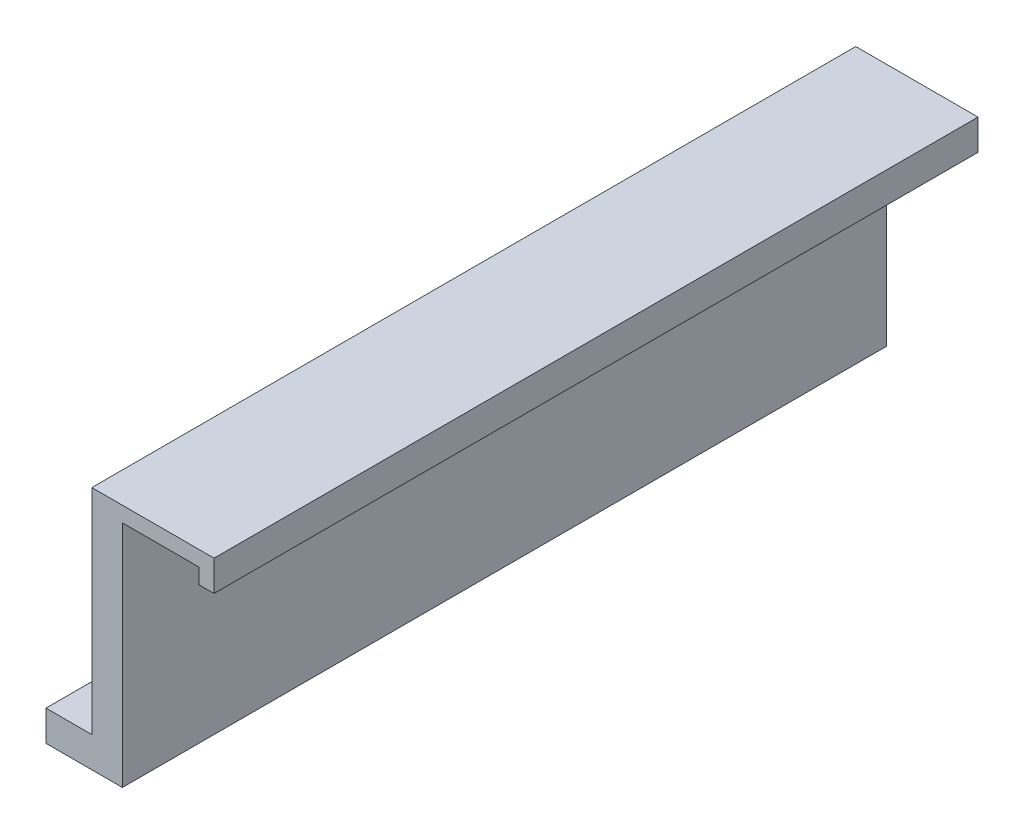
ISO-10303-21;
HEADER;
FILE_DESCRIPTION(('STEP AP214'),'2;1');
FILE_NAME('part.step','',(''),(''),'','','');
FILE_SCHEMA(('AUTOMOTIVE_DESIGN { 1 0 10303 214 1 1 1 1 }'));
ENDSEC;
DATA;
#1=APPLICATION_CONTEXT('core data for automotive mechanical design processes');
#2=APPLICATION_PROTOCOL_DEFINITION('international standard','automotive_design',2000,#1);
#3=PRODUCT_CONTEXT('',#1,'mechanical');
#4=PRODUCT('Part','Part','',(#3));
#5=PRODUCT_RELATED_PRODUCT_CATEGORY('part','',(#4));
#6=PRODUCT_DEFINITION_FORMATION('','',#4);
#7=PRODUCT_DEFINITION_CONTEXT('part definition',#1,'design');
#8=PRODUCT_DEFINITION('design','',#6,#7);
#9=PRODUCT_DEFINITION_SHAPE('','',#8);
#10=(LENGTH_UNIT() NAMED_UNIT(*) SI_UNIT(.MILLI.,.METRE.));
#11=(NAMED_UNIT(*) PLANE_ANGLE_UNIT() SI_UNIT($,.RADIAN.));
#12=(NAMED_UNIT(*) SI_UNIT($,.STERADIAN.) SOLID_ANGLE_UNIT());
#13=UNCERTAINTY_MEASURE_WITH_UNIT(LENGTH_MEASURE(1.E-05),#10,'distance_accuracy_value','');
#14=(GEOMETRIC_REPRESENTATION_CONTEXT(3) GLOBAL_UNCERTAINTY_ASSIGNED_CONTEXT((#13)) GLOBAL_UNIT_ASSIGNED_CONTEXT((#10,
#11,#12)) REPRESENTATION_CONTEXT('',''));
#15=CARTESIAN_POINT('',(0.,0.,0.));
#16=DIRECTION('',(0.,0.,1.));
#17=DIRECTION('',(1.,0.,0.));
#18=AXIS2_PLACEMENT_3D('',#15,#16,#17);
#19=CARTESIAN_POINT('',(0.,0.,0.));
#20=DIRECTION('',(1.,0.,0.));
#21=DIRECTION('',(0.,0.,1.));
#22=AXIS2_PLACEMENT_3D('',#19,#20,#21);
#23=PLANE('',#22);
#24=DIRECTION('',(0.,0.,-1.));
#25=VECTOR('',#24,1.);
#26=CARTESIAN_POINT('',(0.,0.,-100.));
#27=LINE('',#26,#25);
#28=CARTESIAN_POINT('',(0.,0.,0.));
#29=VERTEX_POINT('',#28);
#30=CARTESIAN_POINT('',(0.,0.,-100.));
#31=VERTEX_POINT('',#30);
#32=EDGE_CURVE('E51',#29,#31,#27,.T.);
#33=ORIENTED_EDGE('',*,*,#32,.F.);
#34=DIRECTION('',(0.,-1.,0.));
#35=VECTOR('',#34,1.);
#36=CARTESIAN_POINT('',(0.,0.,0.));
#37=LINE('',#36,#35);
#38=CARTESIAN_POINT('',(0.,28.,0.));
#39=VERTEX_POINT('',#38);
#40=EDGE_CURVE('E44',#39,#29,#37,.T.);
#41=ORIENTED_EDGE('',*,*,#40,.F.);
#42=DIRECTION('',(0.,0.,1.));
#43=VECTOR('',#42,1.);
#44=CARTESIAN_POINT('',(0.,28.,0.));
#45=LINE('',#44,#43);
#46=CARTESIAN_POINT('',(0.,28.,-100.));
#47=VERTEX_POINT('',#46);
#48=EDGE_CURVE('E39',#47,#39,#45,.T.);
#49=ORIENTED_EDGE('',*,*,#48,.F.);
#50=DIRECTION('',(0.,1.,0.));
#51=VECTOR('',#50,1.);
#52=CARTESIAN_POINT('',(0.,0.,-100.));
#53=LINE('',#52,#51);
#54=EDGE_CURVE('E12',#31,#47,#53,.T.);
#55=ORIENTED_EDGE('',*,*,#54,.F.);
#56=EDGE_LOOP('',(#33,#41,#49,#55));
#57=FACE_BOUND('',#56,.T.);
#58=ADVANCED_FACE('F36',(#57),#23,.F.);
#59=CARTESIAN_POINT('',(2.,0.,0.));
#60=DIRECTION('',(0.,0.,-1.));
#61=DIRECTION('',(1.,0.,0.));
#62=AXIS2_PLACEMENT_3D('',#59,#60,#61);
#63=PLANE('',#62);
#64=DIRECTION('',(0.,-1.,0.));
#65=VECTOR('',#64,1.);
#66=CARTESIAN_POINT('',(4.,0.,0.));
#67=LINE('',#66,#65);
#68=CARTESIAN_POINT('',(4.,26.,0.));
#69=VERTEX_POINT('',#68);
#70=CARTESIAN_POINT('',(4.,-4.,0.));
#71=VERTEX_POINT('',#70);
#72=EDGE_CURVE('E86',#69,#71,#67,.T.);
#73=ORIENTED_EDGE('',*,*,#72,.F.);
#74=DIRECTION('',(-1.,0.,0.));
#75=VECTOR('',#74,1.);
#76=CARTESIAN_POINT('',(14.,26.,0.));
#77=LINE('',#76,#75);
#78=CARTESIAN_POINT('',(14.,26.,0.));
#79=VERTEX_POINT('',#78);
#80=EDGE_CURVE('E136',#79,#69,#77,.T.);
#81=ORIENTED_EDGE('',*,*,#80,.F.);
#82=DIRECTION('',(0.,1.,0.));
#83=VECTOR('',#82,1.);
#84=CARTESIAN_POINT('',(14.,24.,0.));
#85=LINE('',#84,#83);
#86=CARTESIAN_POINT('',(14.,24.,0.));
#87=VERTEX_POINT('',#86);
#88=EDGE_CURVE('E117',#87,#79,#85,.T.);
#89=ORIENTED_EDGE('',*,*,#88,.F.);
#90=DIRECTION('',(-1.,0.,0.));
#91=VECTOR('',#90,1.);
#92=CARTESIAN_POINT('',(16.,24.,0.));
#93=LINE('',#92,#91);
#94=CARTESIAN_POINT('',(16.,24.,0.));
#95=VERTEX_POINT('',#94);
#96=EDGE_CURVE('E144',#95,#87,#93,.T.);
#97=ORIENTED_EDGE('',*,*,#96,.F.);
#98=DIRECTION('',(0.,-1.,0.));
#99=VECTOR('',#98,1.);
#100=CARTESIAN_POINT('',(16.,28.,0.));
#101=LINE('',#100,#99);
#102=CARTESIAN_POINT('',(16.,28.,0.));
#103=VERTEX_POINT('',#102);
#104=EDGE_CURVE('E141',#103,#95,#101,.T.);
#105=ORIENTED_EDGE('',*,*,#104,.F.);
#106=DIRECTION('',(1.,0.,0.));
#107=VECTOR('',#106,1.);
#108=CARTESIAN_POINT('',(2.,28.,0.));
#109=LINE('',#108,#107);
#110=EDGE_CURVE('E138',#39,#103,#109,.T.);
#111=ORIENTED_EDGE('',*,*,#110,.F.);
#112=ORIENTED_EDGE('',*,*,#40,.T.);
#113=DIRECTION('',(1.,0.,0.));
#114=VECTOR('',#113,1.);
#115=CARTESIAN_POINT('',(-6.,0.,0.));
#116=LINE('',#115,#114);
#117=CARTESIAN_POINT('',(-6.,0.,0.));
#118=VERTEX_POINT('',#117);
#119=EDGE_CURVE('E164',#118,#29,#116,.T.);
#120=ORIENTED_EDGE('',*,*,#119,.F.);
#121=DIRECTION('',(0.,1.,0.));
#122=VECTOR('',#121,1.);
#123=CARTESIAN_POINT('',(-6.,0.,0.));
#124=LINE('',#123,#122);
#125=CARTESIAN_POINT('',(-6.,-4.,0.));
#126=VERTEX_POINT('',#125);
#127=EDGE_CURVE('E245',#126,#118,#124,.T.);
#128=ORIENTED_EDGE('',*,*,#127,.F.);
#129=DIRECTION('',(-1.,0.,0.));
#130=VECTOR('',#129,1.);
#131=CARTESIAN_POINT('',(104.079968025574,-4.,0.));
#132=LINE('',#131,#130);
#133=EDGE_CURVE('E174',#71,#126,#132,.T.);
#134=ORIENTED_EDGE('',*,*,#133,.F.);
#135=EDGE_LOOP('',(#73,#81,#89,#97,#105,#111,#112,#120,#128,#134));
#136=FACE_BOUND('',#135,.T.);
#137=ADVANCED_FACE('F161',(#136),#63,.F.);
#138=CARTESIAN_POINT('',(2.,0.,-100.));
#139=DIRECTION('',(0.,0.,1.));
#140=DIRECTION('',(-1.,0.,0.));
#141=AXIS2_PLACEMENT_3D('',#138,#139,#140);
#142=PLANE('',#141);
#143=DIRECTION('',(0.,1.,0.));
#144=VECTOR('',#143,1.);
#145=CARTESIAN_POINT('',(4.,0.,-100.));
#146=LINE('',#145,#144);
#147=CARTESIAN_POINT('',(4.,-4.,-100.));
#148=VERTEX_POINT('',#147);
#149=CARTESIAN_POINT('',(4.,26.,-100.));
#150=VERTEX_POINT('',#149);
#151=EDGE_CURVE('E154',#148,#150,#146,.T.);
#152=ORIENTED_EDGE('',*,*,#151,.F.);
#153=DIRECTION('',(-1.,0.,0.));
#154=VECTOR('',#153,1.);
#155=CARTESIAN_POINT('',(104.079968025574,-4.,-100.));
#156=LINE('',#155,#154);
#157=CARTESIAN_POINT('',(-6.,-4.,-100.));
#158=VERTEX_POINT('',#157);
#159=EDGE_CURVE('E178',#148,#158,#156,.T.);
#160=ORIENTED_EDGE('',*,*,#159,.T.);
#161=DIRECTION('',(0.,-1.,0.));
#162=VECTOR('',#161,1.);
#163=CARTESIAN_POINT('',(-6.,0.,-100.));
#164=LINE('',#163,#162);
#165=CARTESIAN_POINT('',(-6.,0.,-100.));
#166=VERTEX_POINT('',#165);
#167=EDGE_CURVE('E238',#166,#158,#164,.T.);
#168=ORIENTED_EDGE('',*,*,#167,.F.);
#169=DIRECTION('',(1.,0.,0.));
#170=VECTOR('',#169,1.);
#171=CARTESIAN_POINT('',(-6.,0.,-100.));
#172=LINE('',#171,#170);
#173=EDGE_CURVE('E175',#166,#31,#172,.T.);
#174=ORIENTED_EDGE('',*,*,#173,.T.);
#175=ORIENTED_EDGE('',*,*,#54,.T.);
#176=DIRECTION('',(-1.,0.,0.));
#177=VECTOR('',#176,1.);
#178=CARTESIAN_POINT('',(2.,28.,-100.));
#179=LINE('',#178,#177);
#180=CARTESIAN_POINT('',(16.,28.,-100.));
#181=VERTEX_POINT('',#180);
#182=EDGE_CURVE('E119',#181,#47,#179,.T.);
#183=ORIENTED_EDGE('',*,*,#182,.F.);
#184=DIRECTION('',(0.,1.,0.));
#185=VECTOR('',#184,1.);
#186=CARTESIAN_POINT('',(16.,28.,-100.));
#187=LINE('',#186,#185);
#188=CARTESIAN_POINT('',(16.,24.,-100.));
#189=VERTEX_POINT('',#188);
#190=EDGE_CURVE('E132',#189,#181,#187,.T.);
#191=ORIENTED_EDGE('',*,*,#190,.F.);
#192=DIRECTION('',(1.,0.,0.));
#193=VECTOR('',#192,1.);
#194=CARTESIAN_POINT('',(16.,24.,-100.));
#195=LINE('',#194,#193);
#196=CARTESIAN_POINT('',(14.,24.,-100.));
#197=VERTEX_POINT('',#196);
#198=EDGE_CURVE('E130',#197,#189,#195,.T.);
#199=ORIENTED_EDGE('',*,*,#198,.F.);
#200=DIRECTION('',(0.,-1.,0.));
#201=VECTOR('',#200,1.);
#202=CARTESIAN_POINT('',(14.,24.,-100.));
#203=LINE('',#202,#201);
#204=CARTESIAN_POINT('',(14.,26.,-100.));
#205=VERTEX_POINT('',#204);
#206=EDGE_CURVE('E114',#205,#197,#203,.T.);
#207=ORIENTED_EDGE('',*,*,#206,.F.);
#208=DIRECTION('',(1.,0.,0.));
#209=VECTOR('',#208,1.);
#210=CARTESIAN_POINT('',(14.,26.,-100.));
#211=LINE('',#210,#209);
#212=EDGE_CURVE('E122',#150,#205,#211,.T.);
#213=ORIENTED_EDGE('',*,*,#212,.F.);
#214=EDGE_LOOP('',(#152,#160,#168,#174,#175,#183,#191,#199,#207,#213));
#215=FACE_BOUND('',#214,.T.);
#216=ADVANCED_FACE('F127',(#215),#142,.F.);
#217=CARTESIAN_POINT('',(4.,0.,0.));
#218=DIRECTION('',(1.,0.,0.));
#219=DIRECTION('',(0.,0.,1.));
#220=AXIS2_PLACEMENT_3D('',#217,#218,#219);
#221=PLANE('',#220);
#222=ORIENTED_EDGE('',*,*,#72,.T.);
#223=DIRECTION('',(0.,0.,-1.));
#224=VECTOR('',#223,1.);
#225=CARTESIAN_POINT('',(4.,-4.,0.));
#226=LINE('',#225,#224);
#227=EDGE_CURVE('E139',#71,#148,#226,.T.);
#228=ORIENTED_EDGE('',*,*,#227,.T.);
#229=ORIENTED_EDGE('',*,*,#151,.T.);
#230=DIRECTION('',(0.,0.,1.));
#231=VECTOR('',#230,1.);
#232=CARTESIAN_POINT('',(4.,26.,0.));
#233=LINE('',#232,#231);
#234=EDGE_CURVE('E60',#150,#69,#233,.T.);
#235=ORIENTED_EDGE('',*,*,#234,.T.);
#236=EDGE_LOOP('',(#222,#228,#229,#235));
#237=FACE_BOUND('',#236,.T.);
#238=ADVANCED_FACE('F209',(#237),#221,.T.);
#239=CARTESIAN_POINT('',(14.,26.,-114.560219778561));
#240=DIRECTION('',(0.,-1.,0.));
#241=DIRECTION('',(0.,0.,-1.));
#242=AXIS2_PLACEMENT_3D('',#239,#240,#241);
#243=PLANE('',#242);
#244=ORIENTED_EDGE('',*,*,#212,.T.);
#245=DIRECTION('',(0.,0.,1.));
#246=VECTOR('',#245,1.);
#247=CARTESIAN_POINT('',(14.,26.,-114.560219778561));
#248=LINE('',#247,#246);
#249=EDGE_CURVE('E111',#205,#79,#248,.T.);
#250=ORIENTED_EDGE('',*,*,#249,.T.);
#251=ORIENTED_EDGE('',*,*,#80,.T.);
#252=ORIENTED_EDGE('',*,*,#234,.F.);
#253=EDGE_LOOP('',(#244,#250,#251,#252));
#254=FACE_BOUND('',#253,.T.);
#255=ADVANCED_FACE('F123',(#254),#243,.T.);
#256=CARTESIAN_POINT('',(14.,24.,-114.560219778561));
#257=DIRECTION('',(-1.,0.,0.));
#258=DIRECTION('',(0.,1.,0.));
#259=AXIS2_PLACEMENT_3D('',#256,#257,#258);
#260=PLANE('',#259);
#261=ORIENTED_EDGE('',*,*,#206,.T.);
#262=DIRECTION('',(0.,0.,1.));
#263=VECTOR('',#262,1.);
#264=CARTESIAN_POINT('',(14.,24.,-114.560219778561));
#265=LINE('',#264,#263);
#266=EDGE_CURVE('E120',#197,#87,#265,.T.);
#267=ORIENTED_EDGE('',*,*,#266,.T.);
#268=ORIENTED_EDGE('',*,*,#88,.T.);
#269=ORIENTED_EDGE('',*,*,#249,.F.);
#270=EDGE_LOOP('',(#261,#267,#268,#269));
#271=FACE_BOUND('',#270,.T.);
#272=ADVANCED_FACE('F112',(#271),#260,.T.);
#273=CARTESIAN_POINT('',(16.,24.,-114.560219778561));
#274=DIRECTION('',(0.,-1.,0.));
#275=DIRECTION('',(0.,0.,-1.));
#276=AXIS2_PLACEMENT_3D('',#273,#274,#275);
#277=PLANE('',#276);
#278=ORIENTED_EDGE('',*,*,#198,.T.);
#279=DIRECTION('',(0.,0.,1.));
#280=VECTOR('',#279,1.);
#281=CARTESIAN_POINT('',(16.,24.,-114.560219778561));
#282=LINE('',#281,#280);
#283=EDGE_CURVE('E149',#189,#95,#282,.T.);
#284=ORIENTED_EDGE('',*,*,#283,.T.);
#285=ORIENTED_EDGE('',*,*,#96,.T.);
#286=ORIENTED_EDGE('',*,*,#266,.F.);
#287=EDGE_LOOP('',(#278,#284,#285,#286));
#288=FACE_BOUND('',#287,.T.);
#289=ADVANCED_FACE('F193',(#288),#277,.T.);
#290=CARTESIAN_POINT('',(16.,28.,-114.560219778561));
#291=DIRECTION('',(1.,0.,0.));
#292=DIRECTION('',(0.,0.,1.));
#293=AXIS2_PLACEMENT_3D('',#290,#291,#292);
#294=PLANE('',#293);
#295=ORIENTED_EDGE('',*,*,#190,.T.);
#296=DIRECTION('',(0.,0.,1.));
#297=VECTOR('',#296,1.);
#298=CARTESIAN_POINT('',(16.,28.,-114.560219778561));
#299=LINE('',#298,#297);
#300=EDGE_CURVE('E151',#181,#103,#299,.T.);
#301=ORIENTED_EDGE('',*,*,#300,.T.);
#302=ORIENTED_EDGE('',*,*,#104,.T.);
#303=ORIENTED_EDGE('',*,*,#283,.F.);
#304=EDGE_LOOP('',(#295,#301,#302,#303));
#305=FACE_BOUND('',#304,.T.);
#306=ADVANCED_FACE('F189',(#305),#294,.T.);
#307=CARTESIAN_POINT('',(2.,28.,-114.560219778561));
#308=DIRECTION('',(0.,1.,0.));
#309=DIRECTION('',(0.,0.,1.));
#310=AXIS2_PLACEMENT_3D('',#307,#308,#309);
#311=PLANE('',#310);
#312=ORIENTED_EDGE('',*,*,#182,.T.);
#313=ORIENTED_EDGE('',*,*,#48,.T.);
#314=ORIENTED_EDGE('',*,*,#110,.T.);
#315=ORIENTED_EDGE('',*,*,#300,.F.);
#316=EDGE_LOOP('',(#312,#313,#314,#315));
#317=FACE_BOUND('',#316,.T.);
#318=ADVANCED_FACE('F190',(#317),#311,.T.);
#319=CARTESIAN_POINT('',(104.079968025574,-4.,0.));
#320=DIRECTION('',(0.,1.,0.));
#321=DIRECTION('',(0.,0.,1.));
#322=AXIS2_PLACEMENT_3D('',#319,#320,#321);
#323=PLANE('',#322);
#324=ORIENTED_EDGE('',*,*,#227,.F.);
#325=ORIENTED_EDGE('',*,*,#133,.T.);
#326=DIRECTION('',(0.,0.,1.));
#327=VECTOR('',#326,1.);
#328=CARTESIAN_POINT('',(-6.,-4.,-100.));
#329=LINE('',#328,#327);
#330=EDGE_CURVE('E242',#158,#126,#329,.T.);
#331=ORIENTED_EDGE('',*,*,#330,.F.);
#332=ORIENTED_EDGE('',*,*,#159,.F.);
#333=EDGE_LOOP('',(#324,#325,#331,#332));
#334=FACE_BOUND('',#333,.T.);
#335=ADVANCED_FACE('F217',(#334),#323,.F.);
#336=CARTESIAN_POINT('',(-6.,0.,-100.));
#337=DIRECTION('',(0.,-1.,0.));
#338=DIRECTION('',(0.,0.,-1.));
#339=AXIS2_PLACEMENT_3D('',#336,#337,#338);
#340=PLANE('',#339);
#341=ORIENTED_EDGE('',*,*,#32,.T.);
#342=ORIENTED_EDGE('',*,*,#173,.F.);
#343=DIRECTION('',(0.,0.,-1.));
#344=VECTOR('',#343,1.);
#345=CARTESIAN_POINT('',(-6.,0.,-100.));
#346=LINE('',#345,#344);
#347=EDGE_CURVE('E173',#118,#166,#346,.T.);
#348=ORIENTED_EDGE('',*,*,#347,.F.);
#349=ORIENTED_EDGE('',*,*,#119,.T.);
#350=EDGE_LOOP('',(#341,#342,#348,#349));
#351=FACE_BOUND('',#350,.T.);
#352=ADVANCED_FACE('F168',(#351),#340,.F.);
#353=CARTESIAN_POINT('',(-6.,0.,0.));
#354=DIRECTION('',(-1.,0.,0.));
#355=DIRECTION('',(0.,0.,1.));
#356=AXIS2_PLACEMENT_3D('',#353,#354,#355);
#357=PLANE('',#356);
#358=ORIENTED_EDGE('',*,*,#167,.T.);
#359=ORIENTED_EDGE('',*,*,#330,.T.);
#360=ORIENTED_EDGE('',*,*,#127,.T.);
#361=ORIENTED_EDGE('',*,*,#347,.T.);
#362=EDGE_LOOP('',(#358,#359,#360,#361));
#363=FACE_BOUND('',#362,.T.);
#364=ADVANCED_FACE('F226',(#363),#357,.T.);
#365=CLOSED_SHELL('',(#58,#137,#216,#238,#255,#272,#289,#306,#318,#335,#352,#364));
#366=MANIFOLD_SOLID_BREP('B2',#365);
#367=ADVANCED_BREP_SHAPE_REPRESENTATION('',(#18,#366),#14);
#368=SHAPE_DEFINITION_REPRESENTATION(#9,#367);
ENDSEC;
END-ISO-10303-21;
